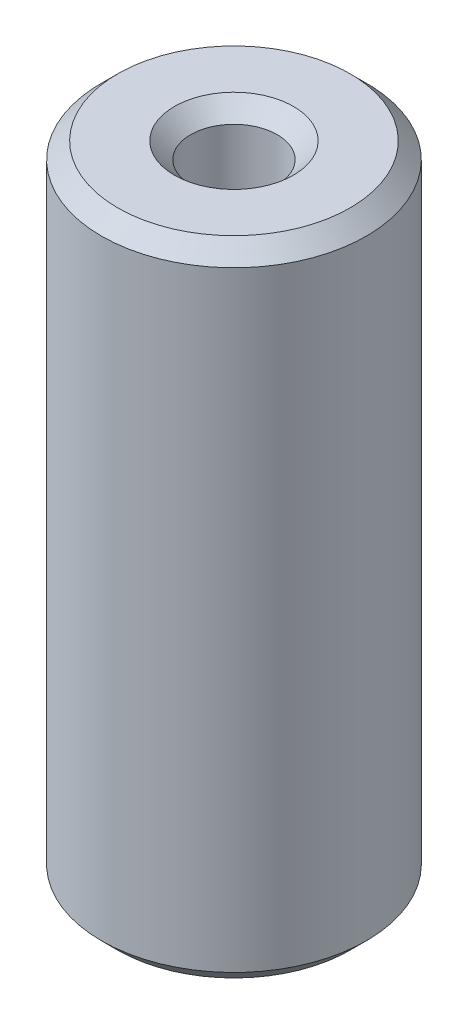
ISO-10303-21;
HEADER;
FILE_DESCRIPTION(('STEP AP214'),'2;1');
FILE_NAME('part.step','',(''),(''),'','','');
FILE_SCHEMA(('AUTOMOTIVE_DESIGN { 1 0 10303 214 1 1 1 1 }'));
ENDSEC;
DATA;
#1=APPLICATION_CONTEXT('core data for automotive mechanical design processes');
#2=APPLICATION_PROTOCOL_DEFINITION('international standard','automotive_design',2000,#1);
#3=PRODUCT_CONTEXT('',#1,'mechanical');
#4=PRODUCT('Part','Part','',(#3));
#5=PRODUCT_RELATED_PRODUCT_CATEGORY('part','',(#4));
#6=PRODUCT_DEFINITION_FORMATION('','',#4);
#7=PRODUCT_DEFINITION_CONTEXT('part definition',#1,'design');
#8=PRODUCT_DEFINITION('design','',#6,#7);
#9=PRODUCT_DEFINITION_SHAPE('','',#8);
#10=(LENGTH_UNIT() NAMED_UNIT(*) SI_UNIT(.MILLI.,.METRE.));
#11=(NAMED_UNIT(*) PLANE_ANGLE_UNIT() SI_UNIT($,.RADIAN.));
#12=(NAMED_UNIT(*) SI_UNIT($,.STERADIAN.) SOLID_ANGLE_UNIT());
#13=UNCERTAINTY_MEASURE_WITH_UNIT(LENGTH_MEASURE(1.E-05),#10,'distance_accuracy_value','');
#14=(GEOMETRIC_REPRESENTATION_CONTEXT(3) GLOBAL_UNCERTAINTY_ASSIGNED_CONTEXT((#13)) GLOBAL_UNIT_ASSIGNED_CONTEXT((#10,
#11,#12)) REPRESENTATION_CONTEXT('',''));
#15=CARTESIAN_POINT('',(0.,0.,0.));
#16=DIRECTION('',(0.,0.,1.));
#17=DIRECTION('',(1.,0.,0.));
#18=AXIS2_PLACEMENT_3D('',#15,#16,#17);
#19=CARTESIAN_POINT('',(0.,48.5225655863077,0.));
#20=DIRECTION('',(0.,-1.,0.));
#21=DIRECTION('',(0.,0.,-1.));
#22=AXIS2_PLACEMENT_3D('',#19,#20,#21);
#23=CYLINDRICAL_SURFACE('',#22,10.);
#24=CARTESIAN_POINT('',(0.,1.22837182485834,0.));
#25=DIRECTION('',(0.,1.,0.));
#26=DIRECTION('',(0.,0.,1.));
#27=AXIS2_PLACEMENT_3D('',#24,#25,#26);
#28=CIRCLE('',#27,10.);
#29=CARTESIAN_POINT('',(0.,1.22837182485834,10.));
#30=VERTEX_POINT('',#29);
#31=EDGE_CURVE('E10',#30,#30,#28,.T.);
#32=ORIENTED_EDGE('',*,*,#31,.T.);
#33=EDGE_LOOP('',(#32));
#34=FACE_BOUND('',#33,.T.);
#35=CARTESIAN_POINT('',(0.,47.2941937614493,0.));
#36=DIRECTION('',(0.,1.,0.));
#37=DIRECTION('',(0.,0.,1.));
#38=AXIS2_PLACEMENT_3D('',#35,#36,#37);
#39=CIRCLE('',#38,10.);
#40=CARTESIAN_POINT('',(0.,47.2941937614493,10.));
#41=VERTEX_POINT('',#40);
#42=EDGE_CURVE('E50',#41,#41,#39,.F.);
#43=ORIENTED_EDGE('',*,*,#42,.T.);
#44=EDGE_LOOP('',(#43));
#45=FACE_BOUND('',#44,.T.);
#46=ADVANCED_FACE('F39',(#34,#45),#23,.T.);
#47=CARTESIAN_POINT('',(0.,48.5225655863077,0.));
#48=DIRECTION('',(0.,1.,0.));
#49=DIRECTION('',(0.,0.,1.));
#50=AXIS2_PLACEMENT_3D('',#47,#48,#49);
#51=PLANE('',#50);
#52=CARTESIAN_POINT('',(0.,48.5225655863077,0.));
#53=DIRECTION('',(0.,1.,0.));
#54=DIRECTION('',(0.,0.,1.));
#55=AXIS2_PLACEMENT_3D('',#52,#53,#54);
#56=CIRCLE('',#55,4.495398535695);
#57=CARTESIAN_POINT('',(0.,48.5225655863077,4.495398535695));
#58=VERTEX_POINT('',#57);
#59=EDGE_CURVE('E58',#58,#58,#56,.F.);
#60=ORIENTED_EDGE('',*,*,#59,.T.);
#61=EDGE_LOOP('',(#60));
#62=FACE_BOUND('',#61,.T.);
#63=CARTESIAN_POINT('',(0.,48.5225655863077,0.));
#64=DIRECTION('',(0.,1.,0.));
#65=DIRECTION('',(0.,0.,1.));
#66=AXIS2_PLACEMENT_3D('',#63,#64,#65);
#67=CIRCLE('',#66,8.77162817514165);
#68=CARTESIAN_POINT('',(0.,48.5225655863077,8.77162817514165));
#69=VERTEX_POINT('',#68);
#70=EDGE_CURVE('E61',#69,#69,#67,.T.);
#71=ORIENTED_EDGE('',*,*,#70,.T.);
#72=EDGE_LOOP('',(#71));
#73=FACE_BOUND('',#72,.T.);
#74=ADVANCED_FACE('F88',(#62,#73),#51,.T.);
#75=CARTESIAN_POINT('',(0.,0.,0.));
#76=DIRECTION('',(0.,1.,0.));
#77=DIRECTION('',(0.,0.,1.));
#78=AXIS2_PLACEMENT_3D('',#75,#76,#77);
#79=PLANE('',#78);
#80=CARTESIAN_POINT('',(0.,0.,0.));
#81=DIRECTION('',(0.,1.,0.));
#82=DIRECTION('',(0.,0.,1.));
#83=AXIS2_PLACEMENT_3D('',#80,#81,#82);
#84=CIRCLE('',#83,4.49539853569498);
#85=CARTESIAN_POINT('',(0.,0.,4.49539853569498));
#86=VERTEX_POINT('',#85);
#87=EDGE_CURVE('E51',#86,#86,#84,.T.);
#88=ORIENTED_EDGE('',*,*,#87,.T.);
#89=EDGE_LOOP('',(#88));
#90=FACE_BOUND('',#89,.T.);
#91=CARTESIAN_POINT('',(0.,0.,0.));
#92=DIRECTION('',(0.,1.,0.));
#93=DIRECTION('',(0.,0.,1.));
#94=AXIS2_PLACEMENT_3D('',#91,#92,#93);
#95=CIRCLE('',#94,8.77162817514166);
#96=CARTESIAN_POINT('',(0.,0.,8.77162817514166));
#97=VERTEX_POINT('',#96);
#98=EDGE_CURVE('E54',#97,#97,#95,.F.);
#99=ORIENTED_EDGE('',*,*,#98,.T.);
#100=EDGE_LOOP('',(#99));
#101=FACE_BOUND('',#100,.T.);
#102=ADVANCED_FACE('F83',(#90,#101),#79,.F.);
#103=CARTESIAN_POINT('',(0.,48.5225655863077,0.));
#104=DIRECTION('',(0.,-1.,0.));
#105=DIRECTION('',(0.,0.,-1.));
#106=AXIS2_PLACEMENT_3D('',#103,#104,#105);
#107=CYLINDRICAL_SURFACE('',#106,3.26702671083664);
#108=CARTESIAN_POINT('',(0.,47.2941937614493,0.));
#109=DIRECTION('',(0.,1.,0.));
#110=DIRECTION('',(0.,0.,1.));
#111=AXIS2_PLACEMENT_3D('',#108,#109,#110);
#112=CIRCLE('',#111,3.26702671083664);
#113=CARTESIAN_POINT('',(0.,47.2941937614493,3.26702671083664));
#114=VERTEX_POINT('',#113);
#115=EDGE_CURVE('E67',#114,#114,#112,.T.);
#116=ORIENTED_EDGE('',*,*,#115,.T.);
#117=EDGE_LOOP('',(#116));
#118=FACE_BOUND('',#117,.T.);
#119=CARTESIAN_POINT('',(0.,1.22837182485835,0.));
#120=DIRECTION('',(0.,1.,0.));
#121=DIRECTION('',(0.,0.,1.));
#122=AXIS2_PLACEMENT_3D('',#119,#120,#121);
#123=CIRCLE('',#122,3.26702671083664);
#124=CARTESIAN_POINT('',(0.,1.22837182485835,3.26702671083664));
#125=VERTEX_POINT('',#124);
#126=EDGE_CURVE('E69',#125,#125,#123,.F.);
#127=ORIENTED_EDGE('',*,*,#126,.T.);
#128=EDGE_LOOP('',(#127));
#129=FACE_BOUND('',#128,.T.);
#130=ADVANCED_FACE('F71',(#118,#129),#107,.F.);
#131=CARTESIAN_POINT('',(0.,47.2941937614493,0.));
#132=DIRECTION('',(0.,1.,0.));
#133=DIRECTION('',(0.,0.,1.));
#134=AXIS2_PLACEMENT_3D('',#131,#132,#133);
#135=CONICAL_SURFACE('',#134,3.26702671083664,0.785398163397454);
#136=ORIENTED_EDGE('',*,*,#59,.F.);
#137=EDGE_LOOP('',(#136));
#138=FACE_BOUND('',#137,.T.);
#139=ORIENTED_EDGE('',*,*,#115,.F.);
#140=EDGE_LOOP('',(#139));
#141=FACE_BOUND('',#140,.T.);
#142=ADVANCED_FACE('F77',(#138,#141),#135,.F.);
#143=CARTESIAN_POINT('',(0.,0.,0.));
#144=DIRECTION('',(0.,-1.,0.));
#145=DIRECTION('',(0.,0.,-1.));
#146=AXIS2_PLACEMENT_3D('',#143,#144,#145);
#147=CONICAL_SURFACE('',#146,4.49539853569498,0.785398163397443);
#148=ORIENTED_EDGE('',*,*,#126,.F.);
#149=EDGE_LOOP('',(#148));
#150=FACE_BOUND('',#149,.T.);
#151=ORIENTED_EDGE('',*,*,#87,.F.);
#152=EDGE_LOOP('',(#151));
#153=FACE_BOUND('',#152,.T.);
#154=ADVANCED_FACE('F73',(#150,#153),#147,.F.);
#155=CARTESIAN_POINT('',(0.,1.22837182485834,0.));
#156=DIRECTION('',(0.,1.,0.));
#157=DIRECTION('',(0.,0.,1.));
#158=AXIS2_PLACEMENT_3D('',#155,#156,#157);
#159=CONICAL_SURFACE('',#158,10.,0.78539816339745);
#160=ORIENTED_EDGE('',*,*,#98,.F.);
#161=EDGE_LOOP('',(#160));
#162=FACE_BOUND('',#161,.T.);
#163=ORIENTED_EDGE('',*,*,#31,.F.);
#164=EDGE_LOOP('',(#163));
#165=FACE_BOUND('',#164,.T.);
#166=ADVANCED_FACE('F76',(#162,#165),#159,.T.);
#167=CARTESIAN_POINT('',(0.,48.5225655863077,0.));
#168=DIRECTION('',(0.,-1.,0.));
#169=DIRECTION('',(0.,0.,-1.));
#170=AXIS2_PLACEMENT_3D('',#167,#168,#169);
#171=CONICAL_SURFACE('',#170,8.77162817514165,0.785398163397443);
#172=ORIENTED_EDGE('',*,*,#42,.F.);
#173=EDGE_LOOP('',(#172));
#174=FACE_BOUND('',#173,.T.);
#175=ORIENTED_EDGE('',*,*,#70,.F.);
#176=EDGE_LOOP('',(#175));
#177=FACE_BOUND('',#176,.T.);
#178=ADVANCED_FACE('F45',(#174,#177),#171,.T.);
#179=CLOSED_SHELL('',(#46,#74,#102,#130,#142,#154,#166,#178));
#180=MANIFOLD_SOLID_BREP('B2',#179);
#181=ADVANCED_BREP_SHAPE_REPRESENTATION('',(#18,#180),#14);
#182=SHAPE_DEFINITION_REPRESENTATION(#9,#181);
ENDSEC;
END-ISO-10303-21;
